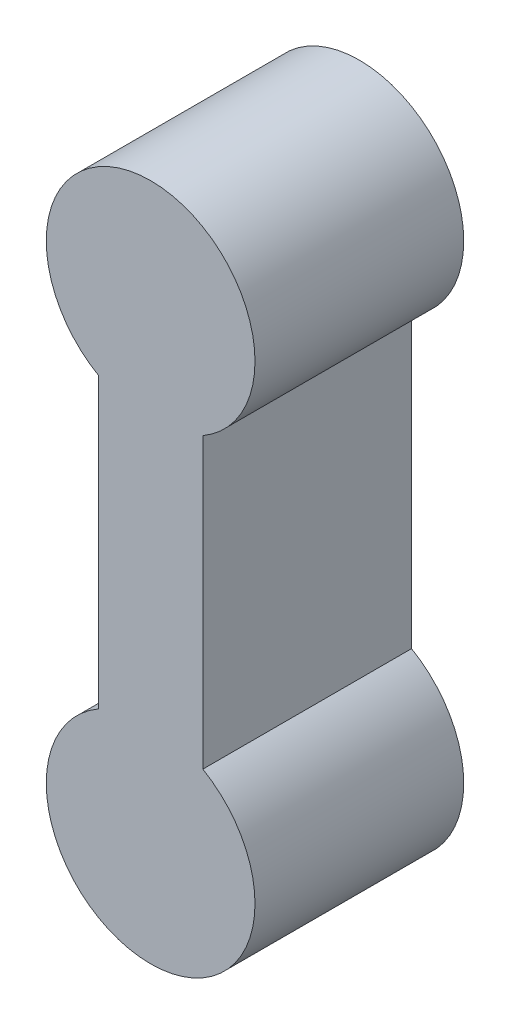
ISO-10303-21;
HEADER;
FILE_DESCRIPTION(('STEP AP214'),'2;1');
FILE_NAME('part.step','',(''),(''),'','','');
FILE_SCHEMA(('AUTOMOTIVE_DESIGN { 1 0 10303 214 1 1 1 1 }'));
ENDSEC;
DATA;
#1=APPLICATION_CONTEXT('core data for automotive mechanical design processes');
#2=APPLICATION_PROTOCOL_DEFINITION('international standard','automotive_design',2000,#1);
#3=PRODUCT_CONTEXT('',#1,'mechanical');
#4=PRODUCT('Part','Part','',(#3));
#5=PRODUCT_RELATED_PRODUCT_CATEGORY('part','',(#4));
#6=PRODUCT_DEFINITION_FORMATION('','',#4);
#7=PRODUCT_DEFINITION_CONTEXT('part definition',#1,'design');
#8=PRODUCT_DEFINITION('design','',#6,#7);
#9=PRODUCT_DEFINITION_SHAPE('','',#8);
#10=(LENGTH_UNIT() NAMED_UNIT(*) SI_UNIT(.MILLI.,.METRE.));
#11=(NAMED_UNIT(*) PLANE_ANGLE_UNIT() SI_UNIT($,.RADIAN.));
#12=(NAMED_UNIT(*) SI_UNIT($,.STERADIAN.) SOLID_ANGLE_UNIT());
#13=UNCERTAINTY_MEASURE_WITH_UNIT(LENGTH_MEASURE(1.E-05),#10,'distance_accuracy_value','');
#14=(GEOMETRIC_REPRESENTATION_CONTEXT(3) GLOBAL_UNCERTAINTY_ASSIGNED_CONTEXT((#13)) GLOBAL_UNIT_ASSIGNED_CONTEXT((#10,
#11,#12)) REPRESENTATION_CONTEXT('',''));
#15=CARTESIAN_POINT('',(0.,0.,0.));
#16=DIRECTION('',(0.,0.,1.));
#17=DIRECTION('',(1.,0.,0.));
#18=AXIS2_PLACEMENT_3D('',#15,#16,#17);
#19=CARTESIAN_POINT('',(0.,2.25,2.));
#20=DIRECTION('',(0.,0.,-1.));
#21=DIRECTION('',(-1.,0.,0.));
#22=AXIS2_PLACEMENT_3D('',#19,#20,#21);
#23=CYLINDRICAL_SURFACE('',#22,1.);
#24=CARTESIAN_POINT('',(0.,2.25,0.));
#25=DIRECTION('',(0.,0.,1.));
#26=DIRECTION('',(1.,0.,0.));
#27=AXIS2_PLACEMENT_3D('',#24,#25,#26);
#28=CIRCLE('',#27,1.);
#29=CARTESIAN_POINT('',(0.5,1.38397459621556,0.));
#30=VERTEX_POINT('',#29);
#31=CARTESIAN_POINT('',(-0.5,1.38397459621556,0.));
#32=VERTEX_POINT('',#31);
#33=EDGE_CURVE('E101',#30,#32,#28,.T.);
#34=ORIENTED_EDGE('',*,*,#33,.T.);
#35=DIRECTION('',(0.,0.,-1.));
#36=VECTOR('',#35,1.);
#37=CARTESIAN_POINT('',(-0.5,1.38397459621556,2.));
#38=LINE('',#37,#36);
#39=CARTESIAN_POINT('',(-0.5,1.38397459621556,2.));
#40=VERTEX_POINT('',#39);
#41=EDGE_CURVE('E11',#40,#32,#38,.T.);
#42=ORIENTED_EDGE('',*,*,#41,.F.);
#43=CARTESIAN_POINT('',(0.,2.25,2.));
#44=DIRECTION('',(0.,0.,1.));
#45=DIRECTION('',(1.,0.,0.));
#46=AXIS2_PLACEMENT_3D('',#43,#44,#45);
#47=CIRCLE('',#46,1.);
#48=CARTESIAN_POINT('',(0.5,1.38397459621556,2.));
#49=VERTEX_POINT('',#48);
#50=EDGE_CURVE('E89',#49,#40,#47,.T.);
#51=ORIENTED_EDGE('',*,*,#50,.F.);
#52=DIRECTION('',(0.,0.,-1.));
#53=VECTOR('',#52,1.);
#54=CARTESIAN_POINT('',(0.5,1.38397459621556,2.));
#55=LINE('',#54,#53);
#56=EDGE_CURVE('E97',#49,#30,#55,.T.);
#57=ORIENTED_EDGE('',*,*,#56,.T.);
#58=EDGE_LOOP('',(#34,#42,#51,#57));
#59=FACE_BOUND('',#58,.T.);
#60=ADVANCED_FACE('F38',(#59),#23,.T.);
#61=CARTESIAN_POINT('',(-0.5,-1.38397459621556,2.));
#62=DIRECTION('',(1.,0.,0.));
#63=DIRECTION('',(0.,0.,-1.));
#64=AXIS2_PLACEMENT_3D('',#61,#62,#63);
#65=PLANE('',#64);
#66=DIRECTION('',(0.,-1.,0.));
#67=VECTOR('',#66,1.);
#68=CARTESIAN_POINT('',(-0.5,-1.38397459621556,0.));
#69=LINE('',#68,#67);
#70=CARTESIAN_POINT('',(-0.5,-1.38397459621556,0.));
#71=VERTEX_POINT('',#70);
#72=EDGE_CURVE('E93',#32,#71,#69,.T.);
#73=ORIENTED_EDGE('',*,*,#72,.T.);
#74=DIRECTION('',(0.,0.,-1.));
#75=VECTOR('',#74,1.);
#76=CARTESIAN_POINT('',(-0.5,-1.38397459621556,2.));
#77=LINE('',#76,#75);
#78=CARTESIAN_POINT('',(-0.5,-1.38397459621556,2.));
#79=VERTEX_POINT('',#78);
#80=EDGE_CURVE('E46',#79,#71,#77,.T.);
#81=ORIENTED_EDGE('',*,*,#80,.F.);
#82=DIRECTION('',(0.,-1.,0.));
#83=VECTOR('',#82,1.);
#84=CARTESIAN_POINT('',(-0.5,-1.38397459621556,2.));
#85=LINE('',#84,#83);
#86=EDGE_CURVE('E84',#40,#79,#85,.T.);
#87=ORIENTED_EDGE('',*,*,#86,.F.);
#88=ORIENTED_EDGE('',*,*,#41,.T.);
#89=EDGE_LOOP('',(#73,#81,#87,#88));
#90=FACE_BOUND('',#89,.T.);
#91=ADVANCED_FACE('F92',(#90),#65,.F.);
#92=CARTESIAN_POINT('',(0.,-2.25,2.));
#93=DIRECTION('',(0.,0.,-1.));
#94=DIRECTION('',(-1.,0.,0.));
#95=AXIS2_PLACEMENT_3D('',#92,#93,#94);
#96=CYLINDRICAL_SURFACE('',#95,1.);
#97=CARTESIAN_POINT('',(0.,-2.25,0.));
#98=DIRECTION('',(0.,0.,1.));
#99=DIRECTION('',(-1.,0.,0.));
#100=AXIS2_PLACEMENT_3D('',#97,#98,#99);
#101=CIRCLE('',#100,1.);
#102=CARTESIAN_POINT('',(0.5,-1.38397459621556,0.));
#103=VERTEX_POINT('',#102);
#104=EDGE_CURVE('E71',#71,#103,#101,.T.);
#105=ORIENTED_EDGE('',*,*,#104,.T.);
#106=DIRECTION('',(0.,0.,-1.));
#107=VECTOR('',#106,1.);
#108=CARTESIAN_POINT('',(0.5,-1.38397459621556,2.));
#109=LINE('',#108,#107);
#110=CARTESIAN_POINT('',(0.5,-1.38397459621556,2.));
#111=VERTEX_POINT('',#110);
#112=EDGE_CURVE('E94',#111,#103,#109,.T.);
#113=ORIENTED_EDGE('',*,*,#112,.F.);
#114=CARTESIAN_POINT('',(0.,-2.25,2.));
#115=DIRECTION('',(0.,0.,1.));
#116=DIRECTION('',(-1.,0.,0.));
#117=AXIS2_PLACEMENT_3D('',#114,#115,#116);
#118=CIRCLE('',#117,1.);
#119=EDGE_CURVE('E87',#79,#111,#118,.T.);
#120=ORIENTED_EDGE('',*,*,#119,.F.);
#121=ORIENTED_EDGE('',*,*,#80,.T.);
#122=EDGE_LOOP('',(#105,#113,#120,#121));
#123=FACE_BOUND('',#122,.T.);
#124=ADVANCED_FACE('F95',(#123),#96,.T.);
#125=CARTESIAN_POINT('',(0.5,-1.38397459621556,2.));
#126=DIRECTION('',(-1.,0.,0.));
#127=DIRECTION('',(0.,0.,1.));
#128=AXIS2_PLACEMENT_3D('',#125,#126,#127);
#129=PLANE('',#128);
#130=DIRECTION('',(0.,1.,0.));
#131=VECTOR('',#130,1.);
#132=CARTESIAN_POINT('',(0.5,-1.38397459621556,0.));
#133=LINE('',#132,#131);
#134=EDGE_CURVE('E77',#103,#30,#133,.T.);
#135=ORIENTED_EDGE('',*,*,#134,.T.);
#136=ORIENTED_EDGE('',*,*,#56,.F.);
#137=DIRECTION('',(0.,1.,0.));
#138=VECTOR('',#137,1.);
#139=CARTESIAN_POINT('',(0.5,-1.38397459621556,2.));
#140=LINE('',#139,#138);
#141=EDGE_CURVE('E54',#111,#49,#140,.T.);
#142=ORIENTED_EDGE('',*,*,#141,.F.);
#143=ORIENTED_EDGE('',*,*,#112,.T.);
#144=EDGE_LOOP('',(#135,#136,#142,#143));
#145=FACE_BOUND('',#144,.T.);
#146=ADVANCED_FACE('F108',(#145),#129,.F.);
#147=CARTESIAN_POINT('',(0.,2.25,2.));
#148=DIRECTION('',(0.,0.,1.));
#149=DIRECTION('',(1.,0.,0.));
#150=AXIS2_PLACEMENT_3D('',#147,#148,#149);
#151=PLANE('',#150);
#152=ORIENTED_EDGE('',*,*,#50,.T.);
#153=ORIENTED_EDGE('',*,*,#86,.T.);
#154=ORIENTED_EDGE('',*,*,#119,.T.);
#155=ORIENTED_EDGE('',*,*,#141,.T.);
#156=EDGE_LOOP('',(#152,#153,#154,#155));
#157=FACE_BOUND('',#156,.T.);
#158=ADVANCED_FACE('F85',(#157),#151,.T.);
#159=CARTESIAN_POINT('',(0.,2.25,0.));
#160=DIRECTION('',(0.,0.,1.));
#161=DIRECTION('',(1.,0.,0.));
#162=AXIS2_PLACEMENT_3D('',#159,#160,#161);
#163=PLANE('',#162);
#164=ORIENTED_EDGE('',*,*,#33,.F.);
#165=ORIENTED_EDGE('',*,*,#134,.F.);
#166=ORIENTED_EDGE('',*,*,#104,.F.);
#167=ORIENTED_EDGE('',*,*,#72,.F.);
#168=EDGE_LOOP('',(#164,#165,#166,#167));
#169=FACE_BOUND('',#168,.T.);
#170=ADVANCED_FACE('F111',(#169),#163,.F.);
#171=CLOSED_SHELL('',(#60,#91,#124,#146,#158,#170));
#172=MANIFOLD_SOLID_BREP('B2',#171);
#173=ADVANCED_BREP_SHAPE_REPRESENTATION('',(#18,#172),#14);
#174=SHAPE_DEFINITION_REPRESENTATION(#9,#173);
ENDSEC;
END-ISO-10303-21;
